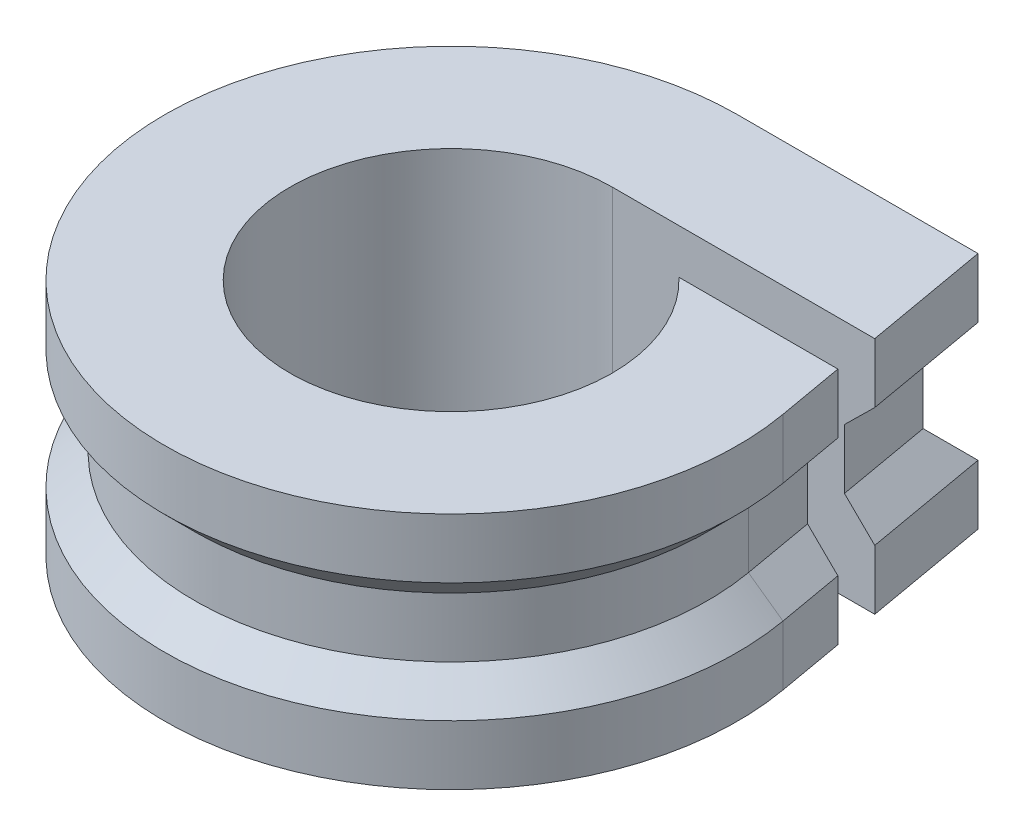
ISO-10303-21;
HEADER;
FILE_DESCRIPTION(('STEP AP214'),'2;1');
FILE_NAME('part.step','',(''),(''),'','','');
FILE_SCHEMA(('AUTOMOTIVE_DESIGN { 1 0 10303 214 1 1 1 1 }'));
ENDSEC;
DATA;
#1=APPLICATION_CONTEXT('core data for automotive mechanical design processes');
#2=APPLICATION_PROTOCOL_DEFINITION('international standard','automotive_design',2000,#1);
#3=PRODUCT_CONTEXT('',#1,'mechanical');
#4=PRODUCT('Part','Part','',(#3));
#5=PRODUCT_RELATED_PRODUCT_CATEGORY('part','',(#4));
#6=PRODUCT_DEFINITION_FORMATION('','',#4);
#7=PRODUCT_DEFINITION_CONTEXT('part definition',#1,'design');
#8=PRODUCT_DEFINITION('design','',#6,#7);
#9=PRODUCT_DEFINITION_SHAPE('','',#8);
#10=(LENGTH_UNIT() NAMED_UNIT(*) SI_UNIT(.MILLI.,.METRE.));
#11=(NAMED_UNIT(*) PLANE_ANGLE_UNIT() SI_UNIT($,.RADIAN.));
#12=(NAMED_UNIT(*) SI_UNIT($,.STERADIAN.) SOLID_ANGLE_UNIT());
#13=UNCERTAINTY_MEASURE_WITH_UNIT(LENGTH_MEASURE(1.E-05),#10,'distance_accuracy_value','');
#14=(GEOMETRIC_REPRESENTATION_CONTEXT(3) GLOBAL_UNCERTAINTY_ASSIGNED_CONTEXT((#13)) GLOBAL_UNIT_ASSIGNED_CONTEXT((#10,
#11,#12)) REPRESENTATION_CONTEXT('',''));
#15=CARTESIAN_POINT('',(0.,0.,0.));
#16=DIRECTION('',(0.,0.,1.));
#17=DIRECTION('',(1.,0.,0.));
#18=AXIS2_PLACEMENT_3D('',#15,#16,#17);
#19=CARTESIAN_POINT('',(0.,3.,-9.6));
#20=DIRECTION('',(0.,0.,-1.));
#21=DIRECTION('',(-1.,0.,0.));
#22=AXIS2_PLACEMENT_3D('',#19,#20,#21);
#23=PLANE('',#22);
#24=DIRECTION('',(0.,-1.,0.));
#25=VECTOR('',#24,1.);
#26=CARTESIAN_POINT('',(0.,3.,-9.6));
#27=LINE('',#26,#25);
#28=CARTESIAN_POINT('',(0.,2.,-9.6));
#29=VERTEX_POINT('',#28);
#30=CARTESIAN_POINT('',(0.,0.,-9.6));
#31=VERTEX_POINT('',#30);
#32=EDGE_CURVE('E258',#29,#31,#27,.T.);
#33=ORIENTED_EDGE('',*,*,#32,.F.);
#34=DIRECTION('',(1.,0.,0.));
#35=VECTOR('',#34,1.);
#36=CARTESIAN_POINT('',(0.,2.,-9.6));
#37=LINE('',#36,#35);
#38=CARTESIAN_POINT('',(8.05535645930192,2.,-9.6));
#39=VERTEX_POINT('',#38);
#40=EDGE_CURVE('E272',#29,#39,#37,.T.);
#41=ORIENTED_EDGE('',*,*,#40,.T.);
#42=DIRECTION('',(0.,-1.,0.));
#43=VECTOR('',#42,1.);
#44=CARTESIAN_POINT('',(8.05535645930192,3.,-9.6));
#45=LINE('',#44,#43);
#46=CARTESIAN_POINT('',(8.05535645930192,0.,-9.6));
#47=VERTEX_POINT('',#46);
#48=EDGE_CURVE('E246',#39,#47,#45,.T.);
#49=ORIENTED_EDGE('',*,*,#48,.T.);
#50=DIRECTION('',(1.,0.,0.));
#51=VECTOR('',#50,1.);
#52=CARTESIAN_POINT('',(0.,0.,-9.6));
#53=LINE('',#52,#51);
#54=EDGE_CURVE('E227',#31,#47,#53,.T.);
#55=ORIENTED_EDGE('',*,*,#54,.F.);
#56=EDGE_LOOP('',(#33,#41,#49,#55));
#57=FACE_BOUND('',#56,.T.);
#58=ADVANCED_FACE('F38',(#57),#23,.T.);
#59=CARTESIAN_POINT('',(0.,3.,0.));
#60=DIRECTION('',(0.,-1.,0.));
#61=DIRECTION('',(0.,0.,-1.));
#62=AXIS2_PLACEMENT_3D('',#59,#60,#61);
#63=CYLINDRICAL_SURFACE('',#62,9.6);
#64=DIRECTION('',(0.,-1.,0.));
#65=VECTOR('',#64,1.);
#66=CARTESIAN_POINT('',(9.4541544289172,3.,-1.6670225056025));
#67=LINE('',#66,#65);
#68=CARTESIAN_POINT('',(9.4541544289172,2.,-1.6670225056025));
#69=VERTEX_POINT('',#68);
#70=CARTESIAN_POINT('',(9.4541544289172,0.,-1.6670225056025));
#71=VERTEX_POINT('',#70);
#72=EDGE_CURVE('E256',#69,#71,#67,.T.);
#73=ORIENTED_EDGE('',*,*,#72,.F.);
#74=CARTESIAN_POINT('',(0.,2.,0.));
#75=DIRECTION('',(0.,1.,0.));
#76=DIRECTION('',(0.,0.,1.));
#77=AXIS2_PLACEMENT_3D('',#74,#75,#76);
#78=CIRCLE('',#77,9.6);
#79=EDGE_CURVE('E11',#69,#29,#78,.F.);
#80=ORIENTED_EDGE('',*,*,#79,.T.);
#81=ORIENTED_EDGE('',*,*,#32,.T.);
#82=CARTESIAN_POINT('',(0.,0.,0.));
#83=DIRECTION('',(0.,1.,0.));
#84=DIRECTION('',(0.,0.,1.));
#85=AXIS2_PLACEMENT_3D('',#82,#83,#84);
#86=CIRCLE('',#85,9.6);
#87=EDGE_CURVE('E230',#31,#71,#86,.T.);
#88=ORIENTED_EDGE('',*,*,#87,.T.);
#89=EDGE_LOOP('',(#73,#80,#81,#88));
#90=FACE_BOUND('',#89,.T.);
#91=ADVANCED_FACE('F375',(#90),#63,.T.);
#92=CARTESIAN_POINT('',(9.4541544289172,3.,-1.6670225056025));
#93=DIRECTION('',(0.984807753012209,0.,-0.173648177666927));
#94=DIRECTION('',(-0.173648177666927,0.,-0.984807753012209));
#95=AXIS2_PLACEMENT_3D('',#92,#93,#94);
#96=PLANE('',#95);
#97=DIRECTION('',(0.,-1.,0.));
#98=VECTOR('',#97,1.);
#99=CARTESIAN_POINT('',(9.06042024934015,3.,-3.9));
#100=LINE('',#99,#98);
#101=CARTESIAN_POINT('',(9.06042024934015,2.,-3.9));
#102=VERTEX_POINT('',#101);
#103=CARTESIAN_POINT('',(9.06042024934015,0.,-3.9));
#104=VERTEX_POINT('',#103);
#105=EDGE_CURVE('E254',#102,#104,#100,.T.);
#106=ORIENTED_EDGE('',*,*,#105,.F.);
#107=DIRECTION('',(0.173648177666927,0.,0.984807753012209));
#108=VECTOR('',#107,1.);
#109=CARTESIAN_POINT('',(9.4541544289172,2.,-1.6670225056025));
#110=LINE('',#109,#108);
#111=EDGE_CURVE('E56',#102,#69,#110,.T.);
#112=ORIENTED_EDGE('',*,*,#111,.T.);
#113=ORIENTED_EDGE('',*,*,#72,.T.);
#114=DIRECTION('',(0.173648177666927,0.,0.984807753012209));
#115=VECTOR('',#114,1.);
#116=CARTESIAN_POINT('',(9.4541544289172,0.,-1.6670225056025));
#117=LINE('',#116,#115);
#118=EDGE_CURVE('E233',#104,#71,#117,.T.);
#119=ORIENTED_EDGE('',*,*,#118,.F.);
#120=EDGE_LOOP('',(#106,#112,#113,#119));
#121=FACE_BOUND('',#120,.T.);
#122=ADVANCED_FACE('F377',(#121),#96,.T.);
#123=CARTESIAN_POINT('',(0.,3.,-3.9));
#124=DIRECTION('',(0.,0.,-1.));
#125=DIRECTION('',(-1.,0.,0.));
#126=AXIS2_PLACEMENT_3D('',#123,#124,#125);
#127=PLANE('',#126);
#128=DIRECTION('',(0.,-1.,0.));
#129=VECTOR('',#128,1.);
#130=CARTESIAN_POINT('',(3.73496987939662,3.,-3.9));
#131=LINE('',#130,#129);
#132=CARTESIAN_POINT('',(3.73496987939662,8.,-3.9));
#133=VERTEX_POINT('',#132);
#134=CARTESIAN_POINT('',(3.73496987939662,0.,-3.9));
#135=VERTEX_POINT('',#134);
#136=EDGE_CURVE('E252',#133,#135,#131,.T.);
#137=ORIENTED_EDGE('',*,*,#136,.F.);
#138=DIRECTION('',(1.,0.,0.));
#139=VECTOR('',#138,1.);
#140=CARTESIAN_POINT('',(0.,8.,-3.9));
#141=LINE('',#140,#139);
#142=CARTESIAN_POINT('',(9.06042024934015,8.,-3.9));
#143=VERTEX_POINT('',#142);
#144=EDGE_CURVE('E328',#133,#143,#141,.T.);
#145=ORIENTED_EDGE('',*,*,#144,.T.);
#146=DIRECTION('',(0.,1.,0.));
#147=VECTOR('',#146,1.);
#148=CARTESIAN_POINT('',(9.06042024934015,5.,-3.9));
#149=LINE('',#148,#147);
#150=CARTESIAN_POINT('',(9.06042024934015,6.,-3.9));
#151=VERTEX_POINT('',#150);
#152=EDGE_CURVE('E298',#151,#143,#149,.T.);
#153=ORIENTED_EDGE('',*,*,#152,.F.);
#154=DIRECTION('',(-0.712498293208666,-0.701673843159867,0.));
#155=VECTOR('',#154,1.);
#156=CARTESIAN_POINT('',(3.96092190302073,0.977974492071662,-3.9));
#157=LINE('',#156,#155);
#158=CARTESIAN_POINT('',(8.04499363745441,5.,-3.9));
#159=VERTEX_POINT('',#158);
#160=EDGE_CURVE('E203',#159,#151,#157,.F.);
#161=ORIENTED_EDGE('',*,*,#160,.F.);
#162=DIRECTION('',(0.,-1.,0.));
#163=VECTOR('',#162,1.);
#164=CARTESIAN_POINT('',(8.04499363745441,4.,-3.9));
#165=LINE('',#164,#163);
#166=CARTESIAN_POINT('',(8.04499363745441,3.,-3.9));
#167=VERTEX_POINT('',#166);
#168=EDGE_CURVE('E208',#159,#167,#165,.T.);
#169=ORIENTED_EDGE('',*,*,#168,.T.);
#170=DIRECTION('',(-0.712498293208666,0.701673843159867,0.));
#171=VECTOR('',#170,1.);
#172=CARTESIAN_POINT('',(3.96092190302073,7.02202550792834,-3.9));
#173=LINE('',#172,#171);
#174=EDGE_CURVE('E48',#167,#102,#173,.F.);
#175=ORIENTED_EDGE('',*,*,#174,.T.);
#176=ORIENTED_EDGE('',*,*,#105,.T.);
#177=DIRECTION('',(1.,0.,0.));
#178=VECTOR('',#177,1.);
#179=CARTESIAN_POINT('',(0.,0.,-3.9));
#180=LINE('',#179,#178);
#181=EDGE_CURVE('E236',#135,#104,#180,.T.);
#182=ORIENTED_EDGE('',*,*,#181,.F.);
#183=EDGE_LOOP('',(#137,#145,#153,#161,#169,#175,#176,#182));
#184=FACE_BOUND('',#183,.T.);
#185=ADVANCED_FACE('F295',(#184),#127,.T.);
#186=CARTESIAN_POINT('',(0.,3.,0.));
#187=DIRECTION('',(0.,-1.,0.));
#188=DIRECTION('',(0.,0.,-1.));
#189=AXIS2_PLACEMENT_3D('',#186,#187,#188);
#190=CYLINDRICAL_SURFACE('',#189,5.4);
#191=CARTESIAN_POINT('',(0.,0.,0.));
#192=DIRECTION('',(0.,1.,0.));
#193=DIRECTION('',(0.,0.,1.));
#194=AXIS2_PLACEMENT_3D('',#191,#192,#193);
#195=CIRCLE('',#194,5.4);
#196=CARTESIAN_POINT('',(0.,0.,-5.4));
#197=VERTEX_POINT('',#196);
#198=EDGE_CURVE('E240',#197,#135,#195,.T.);
#199=ORIENTED_EDGE('',*,*,#198,.F.);
#200=DIRECTION('',(0.,-1.,0.));
#201=VECTOR('',#200,1.);
#202=CARTESIAN_POINT('',(0.,3.,-5.4));
#203=LINE('',#202,#201);
#204=CARTESIAN_POINT('',(0.,8.,-5.4));
#205=VERTEX_POINT('',#204);
#206=EDGE_CURVE('E250',#205,#197,#203,.T.);
#207=ORIENTED_EDGE('',*,*,#206,.F.);
#208=CARTESIAN_POINT('',(0.,8.,0.));
#209=DIRECTION('',(0.,1.,0.));
#210=DIRECTION('',(0.,0.,1.));
#211=AXIS2_PLACEMENT_3D('',#208,#209,#210);
#212=CIRCLE('',#211,5.4);
#213=EDGE_CURVE('E325',#205,#133,#212,.T.);
#214=ORIENTED_EDGE('',*,*,#213,.T.);
#215=ORIENTED_EDGE('',*,*,#136,.T.);
#216=EDGE_LOOP('',(#199,#207,#214,#215));
#217=FACE_BOUND('',#216,.T.);
#218=ADVANCED_FACE('F381',(#217),#190,.F.);
#219=CARTESIAN_POINT('',(0.,3.,-5.4));
#220=DIRECTION('',(0.,0.,-1.));
#221=DIRECTION('',(-1.,0.,0.));
#222=AXIS2_PLACEMENT_3D('',#219,#220,#221);
#223=PLANE('',#222);
#224=DIRECTION('',(0.,-1.,0.));
#225=VECTOR('',#224,1.);
#226=CARTESIAN_POINT('',(8.79592977827745,3.,-5.4));
#227=LINE('',#226,#225);
#228=CARTESIAN_POINT('',(8.79592977827745,2.,-5.4));
#229=VERTEX_POINT('',#228);
#230=CARTESIAN_POINT('',(8.79592977827745,0.,-5.4));
#231=VERTEX_POINT('',#230);
#232=EDGE_CURVE('E248',#229,#231,#227,.T.);
#233=ORIENTED_EDGE('',*,*,#232,.F.);
#234=DIRECTION('',(0.712498293208669,-0.701673843159864,0.));
#235=VECTOR('',#234,1.);
#236=CARTESIAN_POINT('',(9.13008003516142,1.67092623634964,-5.4));
#237=LINE('',#236,#235);
#238=CARTESIAN_POINT('',(7.78050316639171,3.,-5.4));
#239=VERTEX_POINT('',#238);
#240=EDGE_CURVE('E167',#229,#239,#237,.F.);
#241=ORIENTED_EDGE('',*,*,#240,.T.);
#242=DIRECTION('',(0.,-1.,0.));
#243=VECTOR('',#242,1.);
#244=CARTESIAN_POINT('',(7.78050316639171,4.,-5.4));
#245=LINE('',#244,#243);
#246=CARTESIAN_POINT('',(7.78050316639171,5.,-5.4));
#247=VERTEX_POINT('',#246);
#248=EDGE_CURVE('E159',#247,#239,#245,.T.);
#249=ORIENTED_EDGE('',*,*,#248,.F.);
#250=DIRECTION('',(0.712498293208669,0.701673843159864,0.));
#251=VECTOR('',#250,1.);
#252=CARTESIAN_POINT('',(9.13008003516142,6.32907376365036,-5.4));
#253=LINE('',#252,#251);
#254=CARTESIAN_POINT('',(8.79592977827745,6.,-5.4));
#255=VERTEX_POINT('',#254);
#256=EDGE_CURVE('E165',#255,#247,#253,.F.);
#257=ORIENTED_EDGE('',*,*,#256,.F.);
#258=DIRECTION('',(0.,1.,0.));
#259=VECTOR('',#258,1.);
#260=CARTESIAN_POINT('',(8.79592977827745,5.,-5.4));
#261=LINE('',#260,#259);
#262=CARTESIAN_POINT('',(8.79592977827745,8.,-5.4));
#263=VERTEX_POINT('',#262);
#264=EDGE_CURVE('E314',#255,#263,#261,.T.);
#265=ORIENTED_EDGE('',*,*,#264,.T.);
#266=DIRECTION('',(1.,0.,0.));
#267=VECTOR('',#266,1.);
#268=CARTESIAN_POINT('',(0.,8.,-5.4));
#269=LINE('',#268,#267);
#270=EDGE_CURVE('E322',#205,#263,#269,.T.);
#271=ORIENTED_EDGE('',*,*,#270,.F.);
#272=ORIENTED_EDGE('',*,*,#206,.T.);
#273=DIRECTION('',(1.,0.,0.));
#274=VECTOR('',#273,1.);
#275=CARTESIAN_POINT('',(0.,0.,-5.4));
#276=LINE('',#275,#274);
#277=EDGE_CURVE('E243',#197,#231,#276,.T.);
#278=ORIENTED_EDGE('',*,*,#277,.T.);
#279=EDGE_LOOP('',(#233,#241,#249,#257,#265,#271,#272,#278));
#280=FACE_BOUND('',#279,.T.);
#281=ADVANCED_FACE('F162',(#280),#223,.F.);
#282=ORIENTED_EDGE('',*,*,#48,.F.);
#283=DIRECTION('',(0.173648177666927,0.,0.984807753012209));
#284=VECTOR('',#283,1.);
#285=CARTESIAN_POINT('',(9.4541544289172,2.,-1.6670225056025));
#286=LINE('',#285,#284);
#287=EDGE_CURVE('E260',#39,#229,#286,.T.);
#288=ORIENTED_EDGE('',*,*,#287,.T.);
#289=ORIENTED_EDGE('',*,*,#232,.T.);
#290=EDGE_CURVE('E237',#47,#231,#117,.T.);
#291=ORIENTED_EDGE('',*,*,#290,.F.);
#292=EDGE_LOOP('',(#282,#288,#289,#291));
#293=FACE_BOUND('',#292,.T.);
#294=ADVANCED_FACE('F363',(#293),#96,.T.);
#295=CARTESIAN_POINT('',(0.,0.,0.));
#296=DIRECTION('',(0.,1.,0.));
#297=DIRECTION('',(0.,0.,1.));
#298=AXIS2_PLACEMENT_3D('',#295,#296,#297);
#299=PLANE('',#298);
#300=ORIENTED_EDGE('',*,*,#54,.T.);
#301=ORIENTED_EDGE('',*,*,#290,.T.);
#302=ORIENTED_EDGE('',*,*,#277,.F.);
#303=ORIENTED_EDGE('',*,*,#198,.T.);
#304=ORIENTED_EDGE('',*,*,#181,.T.);
#305=ORIENTED_EDGE('',*,*,#118,.T.);
#306=ORIENTED_EDGE('',*,*,#87,.F.);
#307=EDGE_LOOP('',(#300,#301,#302,#303,#304,#305,#306));
#308=FACE_BOUND('',#307,.T.);
#309=ADVANCED_FACE('F369',(#308),#299,.F.);
#310=CARTESIAN_POINT('',(9.4541544289172,2.,-1.6670225056025));
#311=DIRECTION('',(-0.696364240320023,-0.707106781186544,0.122787803968971));
#312=DIRECTION('',(0.173648177666927,0.,0.984807753012209));
#313=AXIS2_PLACEMENT_3D('',#310,#311,#312);
#314=PLANE('',#313);
#315=ORIENTED_EDGE('',*,*,#174,.F.);
#316=DIRECTION('',(-0.173648177666927,0.,-0.984807753012209));
#317=VECTOR('',#316,1.);
#318=CARTESIAN_POINT('',(8.469346675905,3.,-1.49337432793557));
#319=LINE('',#318,#317);
#320=CARTESIAN_POINT('',(8.469346675905,3.,-1.49337432793558));
#321=VERTEX_POINT('',#320);
#322=EDGE_CURVE('E266',#321,#167,#319,.T.);
#323=ORIENTED_EDGE('',*,*,#322,.F.);
#324=DIRECTION('',(-0.696364240320016,0.707106781186551,0.12278780396897));
#325=VECTOR('',#324,1.);
#326=CARTESIAN_POINT('',(9.4541544289172,2.,-1.6670225056025));
#327=LINE('',#326,#325);
#328=EDGE_CURVE('E43',#69,#321,#327,.T.);
#329=ORIENTED_EDGE('',*,*,#328,.F.);
#330=ORIENTED_EDGE('',*,*,#111,.F.);
#331=EDGE_LOOP('',(#315,#323,#329,#330));
#332=FACE_BOUND('',#331,.T.);
#333=ADVANCED_FACE('F41',(#332),#314,.F.);
#334=CARTESIAN_POINT('',(0.,3.,0.));
#335=DIRECTION('',(0.,-1.,0.));
#336=DIRECTION('',(0.,0.,-1.));
#337=AXIS2_PLACEMENT_3D('',#334,#335,#336);
#338=CONICAL_SURFACE('',#337,8.6,0.785398163397445);
#339=ORIENTED_EDGE('',*,*,#328,.T.);
#340=CARTESIAN_POINT('',(0.,3.,0.));
#341=DIRECTION('',(0.,1.,0.));
#342=DIRECTION('',(0.,0.,1.));
#343=AXIS2_PLACEMENT_3D('',#340,#341,#342);
#344=CIRCLE('',#343,8.6);
#345=CARTESIAN_POINT('',(0.,3.,-8.6));
#346=VERTEX_POINT('',#345);
#347=EDGE_CURVE('E264',#346,#321,#344,.T.);
#348=ORIENTED_EDGE('',*,*,#347,.F.);
#349=DIRECTION('',(0.,0.70710678118655,0.707106781186545));
#350=VECTOR('',#349,1.);
#351=CARTESIAN_POINT('',(0.,2.,-9.6));
#352=LINE('',#351,#350);
#353=EDGE_CURVE('E277',#29,#346,#352,.T.);
#354=ORIENTED_EDGE('',*,*,#353,.F.);
#355=ORIENTED_EDGE('',*,*,#79,.F.);
#356=EDGE_LOOP('',(#339,#348,#354,#355));
#357=FACE_BOUND('',#356,.T.);
#358=ADVANCED_FACE('F288',(#357),#338,.T.);
#359=CARTESIAN_POINT('',(0.,2.,-9.6));
#360=DIRECTION('',(0.,-0.707106781186545,0.70710678118655));
#361=DIRECTION('',(1.,0.,0.));
#362=AXIS2_PLACEMENT_3D('',#359,#360,#361);
#363=PLANE('',#362);
#364=ORIENTED_EDGE('',*,*,#353,.T.);
#365=DIRECTION('',(-1.,0.,0.));
#366=VECTOR('',#365,1.);
#367=CARTESIAN_POINT('',(0.,3.,-8.6));
#368=LINE('',#367,#366);
#369=CARTESIAN_POINT('',(7.21625682812463,3.,-8.6));
#370=VERTEX_POINT('',#369);
#371=EDGE_CURVE('E268',#370,#346,#368,.T.);
#372=ORIENTED_EDGE('',*,*,#371,.F.);
#373=DIRECTION('',(0.510273605374739,-0.608120402411344,-0.60812040241134));
#374=VECTOR('',#373,1.);
#375=CARTESIAN_POINT('',(5.95790957261514,4.49963986248449,-7.10036013751552));
#376=LINE('',#375,#374);
#377=EDGE_CURVE('E170',#39,#370,#376,.F.);
#378=ORIENTED_EDGE('',*,*,#377,.F.);
#379=ORIENTED_EDGE('',*,*,#40,.F.);
#380=EDGE_LOOP('',(#364,#372,#378,#379));
#381=FACE_BOUND('',#380,.T.);
#382=ADVANCED_FACE('F357',(#381),#363,.F.);
#383=CARTESIAN_POINT('',(9.4541544289172,2.,-1.6670225056025));
#384=DIRECTION('',(-0.69636424032002,-0.707106781186547,0.122787803968971));
#385=DIRECTION('',(0.173648177666927,0.,0.984807753012209));
#386=AXIS2_PLACEMENT_3D('',#383,#384,#385);
#387=PLANE('',#386);
#388=ORIENTED_EDGE('',*,*,#377,.T.);
#389=DIRECTION('',(-0.173648177666927,0.,-0.984807753012209));
#390=VECTOR('',#389,1.);
#391=CARTESIAN_POINT('',(8.46934667590499,3.,-1.49337432793557));
#392=LINE('',#391,#390);
#393=EDGE_CURVE('E270',#239,#370,#392,.T.);
#394=ORIENTED_EDGE('',*,*,#393,.F.);
#395=ORIENTED_EDGE('',*,*,#240,.F.);
#396=ORIENTED_EDGE('',*,*,#287,.F.);
#397=EDGE_LOOP('',(#388,#394,#395,#396));
#398=FACE_BOUND('',#397,.T.);
#399=ADVANCED_FACE('F360',(#398),#387,.F.);
#400=CARTESIAN_POINT('',(7.78050316639171,4.,-5.4));
#401=DIRECTION('',(-0.984807753012209,0.,0.173648177666927));
#402=DIRECTION('',(0.173648177666927,0.,0.984807753012209));
#403=AXIS2_PLACEMENT_3D('',#400,#401,#402);
#404=PLANE('',#403);
#405=ORIENTED_EDGE('',*,*,#393,.T.);
#406=DIRECTION('',(0.,-1.,0.));
#407=VECTOR('',#406,1.);
#408=CARTESIAN_POINT('',(7.21625682812463,4.,-8.6));
#409=LINE('',#408,#407);
#410=CARTESIAN_POINT('',(7.21625682812463,5.,-8.6));
#411=VERTEX_POINT('',#410);
#412=EDGE_CURVE('E171',#411,#370,#409,.T.);
#413=ORIENTED_EDGE('',*,*,#412,.F.);
#414=DIRECTION('',(-0.173648177666927,0.,-0.984807753012209));
#415=VECTOR('',#414,1.);
#416=CARTESIAN_POINT('',(8.46934667590499,5.,-1.49337432793557));
#417=LINE('',#416,#415);
#418=EDGE_CURVE('E174',#247,#411,#417,.T.);
#419=ORIENTED_EDGE('',*,*,#418,.F.);
#420=ORIENTED_EDGE('',*,*,#248,.T.);
#421=EDGE_LOOP('',(#405,#413,#419,#420));
#422=FACE_BOUND('',#421,.T.);
#423=ADVANCED_FACE('F175',(#422),#404,.F.);
#424=CARTESIAN_POINT('',(7.21625682812463,4.,-8.6));
#425=DIRECTION('',(0.,0.,1.));
#426=DIRECTION('',(1.,0.,0.));
#427=AXIS2_PLACEMENT_3D('',#424,#425,#426);
#428=PLANE('',#427);
#429=ORIENTED_EDGE('',*,*,#371,.T.);
#430=DIRECTION('',(0.,-1.,0.));
#431=VECTOR('',#430,1.);
#432=CARTESIAN_POINT('',(0.,4.,-8.6));
#433=LINE('',#432,#431);
#434=CARTESIAN_POINT('',(0.,5.,-8.6));
#435=VERTEX_POINT('',#434);
#436=EDGE_CURVE('E223',#435,#346,#433,.T.);
#437=ORIENTED_EDGE('',*,*,#436,.F.);
#438=DIRECTION('',(-1.,0.,0.));
#439=VECTOR('',#438,1.);
#440=CARTESIAN_POINT('',(0.,5.,-8.6));
#441=LINE('',#440,#439);
#442=EDGE_CURVE('E180',#411,#435,#441,.T.);
#443=ORIENTED_EDGE('',*,*,#442,.F.);
#444=ORIENTED_EDGE('',*,*,#412,.T.);
#445=EDGE_LOOP('',(#429,#437,#443,#444));
#446=FACE_BOUND('',#445,.T.);
#447=ADVANCED_FACE('F355',(#446),#428,.F.);
#448=CARTESIAN_POINT('',(0.,4.,0.));
#449=DIRECTION('',(0.,-1.,0.));
#450=DIRECTION('',(0.,0.,-1.));
#451=AXIS2_PLACEMENT_3D('',#448,#449,#450);
#452=CYLINDRICAL_SURFACE('',#451,8.6);
#453=ORIENTED_EDGE('',*,*,#347,.T.);
#454=DIRECTION('',(0.,-1.,0.));
#455=VECTOR('',#454,1.);
#456=CARTESIAN_POINT('',(8.469346675905,4.,-1.49337432793558));
#457=LINE('',#456,#455);
#458=CARTESIAN_POINT('',(8.469346675905,5.,-1.49337432793558));
#459=VERTEX_POINT('',#458);
#460=EDGE_CURVE('E220',#459,#321,#457,.T.);
#461=ORIENTED_EDGE('',*,*,#460,.F.);
#462=CARTESIAN_POINT('',(0.,5.,0.));
#463=DIRECTION('',(0.,1.,0.));
#464=DIRECTION('',(0.,0.,1.));
#465=AXIS2_PLACEMENT_3D('',#462,#463,#464);
#466=CIRCLE('',#465,8.6);
#467=EDGE_CURVE('E185',#435,#459,#466,.T.);
#468=ORIENTED_EDGE('',*,*,#467,.F.);
#469=ORIENTED_EDGE('',*,*,#436,.T.);
#470=EDGE_LOOP('',(#453,#461,#468,#469));
#471=FACE_BOUND('',#470,.T.);
#472=ADVANCED_FACE('F353',(#471),#452,.T.);
#473=CARTESIAN_POINT('',(8.469346675905,4.,-1.49337432793558));
#474=DIRECTION('',(-0.984807753012209,0.,0.173648177666927));
#475=DIRECTION('',(0.173648177666927,0.,0.984807753012209));
#476=AXIS2_PLACEMENT_3D('',#473,#474,#475);
#477=PLANE('',#476);
#478=ORIENTED_EDGE('',*,*,#322,.T.);
#479=ORIENTED_EDGE('',*,*,#168,.F.);
#480=DIRECTION('',(-0.173648177666927,0.,-0.984807753012209));
#481=VECTOR('',#480,1.);
#482=CARTESIAN_POINT('',(8.469346675905,5.,-1.49337432793557));
#483=LINE('',#482,#481);
#484=EDGE_CURVE('E188',#459,#159,#483,.T.);
#485=ORIENTED_EDGE('',*,*,#484,.F.);
#486=ORIENTED_EDGE('',*,*,#460,.T.);
#487=EDGE_LOOP('',(#478,#479,#485,#486));
#488=FACE_BOUND('',#487,.T.);
#489=ADVANCED_FACE('F292',(#488),#477,.F.);
#490=CARTESIAN_POINT('',(0.,5.,-9.6));
#491=DIRECTION('',(0.,0.,-1.));
#492=DIRECTION('',(-1.,0.,0.));
#493=AXIS2_PLACEMENT_3D('',#490,#491,#492);
#494=PLANE('',#493);
#495=DIRECTION('',(0.,1.,0.));
#496=VECTOR('',#495,1.);
#497=CARTESIAN_POINT('',(0.,5.,-9.6));
#498=LINE('',#497,#496);
#499=CARTESIAN_POINT('',(0.,6.,-9.6));
#500=VERTEX_POINT('',#499);
#501=CARTESIAN_POINT('',(0.,8.,-9.6));
#502=VERTEX_POINT('',#501);
#503=EDGE_CURVE('E190',#500,#502,#498,.T.);
#504=ORIENTED_EDGE('',*,*,#503,.T.);
#505=DIRECTION('',(1.,0.,0.));
#506=VECTOR('',#505,1.);
#507=CARTESIAN_POINT('',(0.,8.,-9.6));
#508=LINE('',#507,#506);
#509=CARTESIAN_POINT('',(8.05535645930192,8.,-9.6));
#510=VERTEX_POINT('',#509);
#511=EDGE_CURVE('E218',#502,#510,#508,.T.);
#512=ORIENTED_EDGE('',*,*,#511,.T.);
#513=DIRECTION('',(0.,1.,0.));
#514=VECTOR('',#513,1.);
#515=CARTESIAN_POINT('',(8.05535645930192,5.,-9.6));
#516=LINE('',#515,#514);
#517=CARTESIAN_POINT('',(8.05535645930192,6.,-9.6));
#518=VERTEX_POINT('',#517);
#519=EDGE_CURVE('E318',#518,#510,#516,.T.);
#520=ORIENTED_EDGE('',*,*,#519,.F.);
#521=DIRECTION('',(1.,0.,0.));
#522=VECTOR('',#521,1.);
#523=CARTESIAN_POINT('',(0.,6.,-9.6));
#524=LINE('',#523,#522);
#525=EDGE_CURVE('E179',#500,#518,#524,.T.);
#526=ORIENTED_EDGE('',*,*,#525,.F.);
#527=EDGE_LOOP('',(#504,#512,#520,#526));
#528=FACE_BOUND('',#527,.T.);
#529=ADVANCED_FACE('F337',(#528),#494,.T.);
#530=CARTESIAN_POINT('',(0.,5.,0.));
#531=DIRECTION('',(0.,1.,0.));
#532=DIRECTION('',(0.,0.,-1.));
#533=AXIS2_PLACEMENT_3D('',#530,#531,#532);
#534=CYLINDRICAL_SURFACE('',#533,9.6);
#535=DIRECTION('',(0.,1.,0.));
#536=VECTOR('',#535,1.);
#537=CARTESIAN_POINT('',(9.4541544289172,5.,-1.6670225056025));
#538=LINE('',#537,#536);
#539=CARTESIAN_POINT('',(9.4541544289172,6.,-1.6670225056025));
#540=VERTEX_POINT('',#539);
#541=CARTESIAN_POINT('',(9.4541544289172,8.,-1.6670225056025));
#542=VERTEX_POINT('',#541);
#543=EDGE_CURVE('E307',#540,#542,#538,.T.);
#544=ORIENTED_EDGE('',*,*,#543,.T.);
#545=CARTESIAN_POINT('',(0.,8.,0.));
#546=DIRECTION('',(0.,1.,0.));
#547=DIRECTION('',(0.,0.,1.));
#548=AXIS2_PLACEMENT_3D('',#545,#546,#547);
#549=CIRCLE('',#548,9.6);
#550=EDGE_CURVE('E331',#502,#542,#549,.T.);
#551=ORIENTED_EDGE('',*,*,#550,.F.);
#552=ORIENTED_EDGE('',*,*,#503,.F.);
#553=CARTESIAN_POINT('',(0.,6.,0.));
#554=DIRECTION('',(0.,1.,0.));
#555=DIRECTION('',(0.,0.,1.));
#556=AXIS2_PLACEMENT_3D('',#553,#554,#555);
#557=CIRCLE('',#556,9.6);
#558=EDGE_CURVE('E205',#540,#500,#557,.F.);
#559=ORIENTED_EDGE('',*,*,#558,.F.);
#560=EDGE_LOOP('',(#544,#551,#552,#559));
#561=FACE_BOUND('',#560,.T.);
#562=ADVANCED_FACE('F348',(#561),#534,.T.);
#563=CARTESIAN_POINT('',(9.4541544289172,5.,-1.6670225056025));
#564=DIRECTION('',(0.984807753012209,0.,-0.173648177666927));
#565=DIRECTION('',(-0.173648177666927,0.,-0.984807753012209));
#566=AXIS2_PLACEMENT_3D('',#563,#564,#565);
#567=PLANE('',#566);
#568=ORIENTED_EDGE('',*,*,#152,.T.);
#569=DIRECTION('',(0.173648177666927,0.,0.984807753012209));
#570=VECTOR('',#569,1.);
#571=CARTESIAN_POINT('',(9.4541544289172,8.,-1.6670225056025));
#572=LINE('',#571,#570);
#573=EDGE_CURVE('E309',#143,#542,#572,.T.);
#574=ORIENTED_EDGE('',*,*,#573,.T.);
#575=ORIENTED_EDGE('',*,*,#543,.F.);
#576=DIRECTION('',(0.173648177666927,0.,0.984807753012209));
#577=VECTOR('',#576,1.);
#578=CARTESIAN_POINT('',(9.4541544289172,6.,-1.6670225056025));
#579=LINE('',#578,#577);
#580=EDGE_CURVE('E200',#151,#540,#579,.T.);
#581=ORIENTED_EDGE('',*,*,#580,.F.);
#582=EDGE_LOOP('',(#568,#574,#575,#581));
#583=FACE_BOUND('',#582,.T.);
#584=ADVANCED_FACE('F305',(#583),#567,.T.);
#585=ORIENTED_EDGE('',*,*,#519,.T.);
#586=EDGE_CURVE('E321',#510,#263,#572,.T.);
#587=ORIENTED_EDGE('',*,*,#586,.T.);
#588=ORIENTED_EDGE('',*,*,#264,.F.);
#589=DIRECTION('',(0.173648177666927,0.,0.984807753012209));
#590=VECTOR('',#589,1.);
#591=CARTESIAN_POINT('',(9.4541544289172,6.,-1.6670225056025));
#592=LINE('',#591,#590);
#593=EDGE_CURVE('E184',#518,#255,#592,.T.);
#594=ORIENTED_EDGE('',*,*,#593,.F.);
#595=EDGE_LOOP('',(#585,#587,#588,#594));
#596=FACE_BOUND('',#595,.T.);
#597=ADVANCED_FACE('F345',(#596),#567,.T.);
#598=CARTESIAN_POINT('',(0.,8.,0.));
#599=DIRECTION('',(0.,-1.,0.));
#600=DIRECTION('',(0.,0.,1.));
#601=AXIS2_PLACEMENT_3D('',#598,#599,#600);
#602=PLANE('',#601);
#603=ORIENTED_EDGE('',*,*,#511,.F.);
#604=ORIENTED_EDGE('',*,*,#550,.T.);
#605=ORIENTED_EDGE('',*,*,#573,.F.);
#606=ORIENTED_EDGE('',*,*,#144,.F.);
#607=ORIENTED_EDGE('',*,*,#213,.F.);
#608=ORIENTED_EDGE('',*,*,#270,.T.);
#609=ORIENTED_EDGE('',*,*,#586,.F.);
#610=EDGE_LOOP('',(#603,#604,#605,#606,#607,#608,#609));
#611=FACE_BOUND('',#610,.T.);
#612=ADVANCED_FACE('F341',(#611),#602,.F.);
#613=CARTESIAN_POINT('',(9.4541544289172,6.,-1.6670225056025));
#614=DIRECTION('',(-0.696364240320023,0.707106781186544,0.122787803968971));
#615=DIRECTION('',(0.173648177666927,0.,0.984807753012209));
#616=AXIS2_PLACEMENT_3D('',#613,#614,#615);
#617=PLANE('',#616);
#618=ORIENTED_EDGE('',*,*,#160,.T.);
#619=ORIENTED_EDGE('',*,*,#580,.T.);
#620=DIRECTION('',(-0.696364240320016,-0.707106781186551,0.12278780396897));
#621=VECTOR('',#620,1.);
#622=CARTESIAN_POINT('',(9.4541544289172,6.,-1.6670225056025));
#623=LINE('',#622,#621);
#624=EDGE_CURVE('E215',#540,#459,#623,.T.);
#625=ORIENTED_EDGE('',*,*,#624,.T.);
#626=ORIENTED_EDGE('',*,*,#484,.T.);
#627=EDGE_LOOP('',(#618,#619,#625,#626));
#628=FACE_BOUND('',#627,.T.);
#629=ADVANCED_FACE('F301',(#628),#617,.F.);
#630=CARTESIAN_POINT('',(0.,5.,0.));
#631=DIRECTION('',(0.,1.,0.));
#632=DIRECTION('',(0.,0.,-1.));
#633=AXIS2_PLACEMENT_3D('',#630,#631,#632);
#634=CONICAL_SURFACE('',#633,8.6,0.785398163397445);
#635=ORIENTED_EDGE('',*,*,#624,.F.);
#636=ORIENTED_EDGE('',*,*,#558,.T.);
#637=DIRECTION('',(0.,-0.70710678118655,0.707106781186545));
#638=VECTOR('',#637,1.);
#639=CARTESIAN_POINT('',(0.,6.,-9.6));
#640=LINE('',#639,#638);
#641=EDGE_CURVE('E212',#500,#435,#640,.T.);
#642=ORIENTED_EDGE('',*,*,#641,.T.);
#643=ORIENTED_EDGE('',*,*,#467,.T.);
#644=EDGE_LOOP('',(#635,#636,#642,#643));
#645=FACE_BOUND('',#644,.T.);
#646=ADVANCED_FACE('F350',(#645),#634,.T.);
#647=CARTESIAN_POINT('',(0.,6.,-9.6));
#648=DIRECTION('',(0.,0.707106781186545,0.70710678118655));
#649=DIRECTION('',(1.,0.,0.));
#650=AXIS2_PLACEMENT_3D('',#647,#648,#649);
#651=PLANE('',#650);
#652=ORIENTED_EDGE('',*,*,#641,.F.);
#653=ORIENTED_EDGE('',*,*,#525,.T.);
#654=DIRECTION('',(0.510273605374739,0.608120402411344,-0.60812040241134));
#655=VECTOR('',#654,1.);
#656=CARTESIAN_POINT('',(5.95790957261514,3.50036013751551,-7.10036013751552));
#657=LINE('',#656,#655);
#658=EDGE_CURVE('E209',#518,#411,#657,.F.);
#659=ORIENTED_EDGE('',*,*,#658,.T.);
#660=ORIENTED_EDGE('',*,*,#442,.T.);
#661=EDGE_LOOP('',(#652,#653,#659,#660));
#662=FACE_BOUND('',#661,.T.);
#663=ADVANCED_FACE('F347',(#662),#651,.F.);
#664=CARTESIAN_POINT('',(9.4541544289172,6.,-1.6670225056025));
#665=DIRECTION('',(-0.69636424032002,0.707106781186547,0.122787803968971));
#666=DIRECTION('',(0.173648177666927,0.,0.984807753012209));
#667=AXIS2_PLACEMENT_3D('',#664,#665,#666);
#668=PLANE('',#667);
#669=ORIENTED_EDGE('',*,*,#658,.F.);
#670=ORIENTED_EDGE('',*,*,#593,.T.);
#671=ORIENTED_EDGE('',*,*,#256,.T.);
#672=ORIENTED_EDGE('',*,*,#418,.T.);
#673=EDGE_LOOP('',(#669,#670,#671,#672));
#674=FACE_BOUND('',#673,.T.);
#675=ADVANCED_FACE('F182',(#674),#668,.F.);
#676=CLOSED_SHELL('',(#58,#91,#122,#185,#218,#281,#294,#309,#333,#358,#382,#399,#423,#447,#472,
#489,#529,#562,#584,#597,#612,#629,#646,#663,#675));
#677=MANIFOLD_SOLID_BREP('B2',#676);
#678=ADVANCED_BREP_SHAPE_REPRESENTATION('',(#18,#677),#14);
#679=SHAPE_DEFINITION_REPRESENTATION(#9,#678);
ENDSEC;
END-ISO-10303-21;
